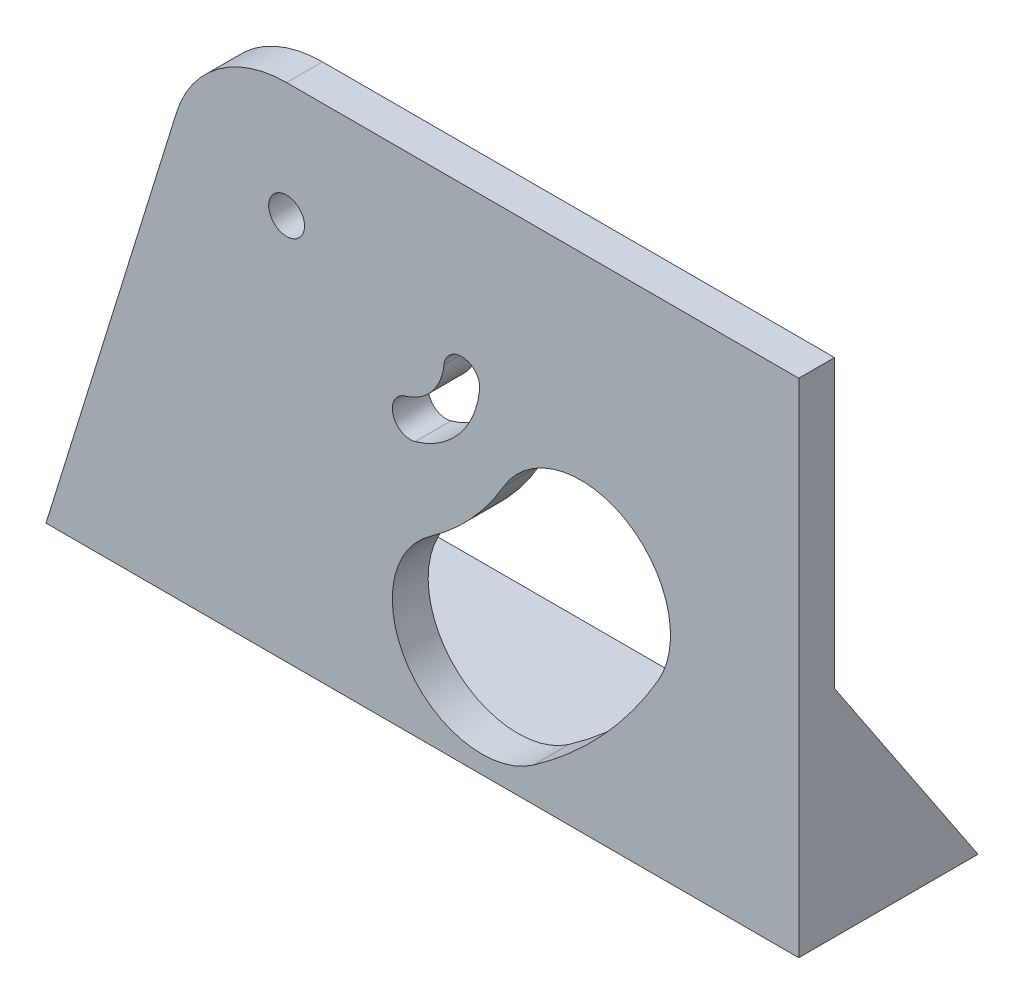
ISO-10303-21;
HEADER;
FILE_DESCRIPTION(('STEP AP214'),'2;1');
FILE_NAME('part.step','',(''),(''),'','','');
FILE_SCHEMA(('AUTOMOTIVE_DESIGN { 1 0 10303 214 1 1 1 1 }'));
ENDSEC;
DATA;
#1=APPLICATION_CONTEXT('core data for automotive mechanical design processes');
#2=APPLICATION_PROTOCOL_DEFINITION('international standard','automotive_design',2000,#1);
#3=PRODUCT_CONTEXT('',#1,'mechanical');
#4=PRODUCT('Part','Part','',(#3));
#5=PRODUCT_RELATED_PRODUCT_CATEGORY('part','',(#4));
#6=PRODUCT_DEFINITION_FORMATION('','',#4);
#7=PRODUCT_DEFINITION_CONTEXT('part definition',#1,'design');
#8=PRODUCT_DEFINITION('design','',#6,#7);
#9=PRODUCT_DEFINITION_SHAPE('','',#8);
#10=(LENGTH_UNIT() NAMED_UNIT(*) SI_UNIT(.MILLI.,.METRE.));
#11=(NAMED_UNIT(*) PLANE_ANGLE_UNIT() SI_UNIT($,.RADIAN.));
#12=(NAMED_UNIT(*) SI_UNIT($,.STERADIAN.) SOLID_ANGLE_UNIT());
#13=UNCERTAINTY_MEASURE_WITH_UNIT(LENGTH_MEASURE(1.E-05),#10,'distance_accuracy_value','');
#14=(GEOMETRIC_REPRESENTATION_CONTEXT(3) GLOBAL_UNCERTAINTY_ASSIGNED_CONTEXT((#13)) GLOBAL_UNIT_ASSIGNED_CONTEXT((#10,
#11,#12)) REPRESENTATION_CONTEXT('',''));
#15=CARTESIAN_POINT('',(0.,0.,0.));
#16=DIRECTION('',(0.,0.,1.));
#17=DIRECTION('',(1.,0.,0.));
#18=AXIS2_PLACEMENT_3D('',#15,#16,#17);
#19=CARTESIAN_POINT('',(0.,0.,0.));
#20=DIRECTION('',(0.,0.,-1.));
#21=DIRECTION('',(-1.,0.,0.));
#22=AXIS2_PLACEMENT_3D('',#19,#20,#21);
#23=PLANE('',#22);
#24=CARTESIAN_POINT('',(89.6049653149398,30.,0.));
#25=DIRECTION('',(0.,0.,1.));
#26=DIRECTION('',(1.,0.,0.));
#27=AXIS2_PLACEMENT_3D('',#24,#25,#26);
#28=CIRCLE('',#27,12.5);
#29=CARTESIAN_POINT('',(100.405906553685,23.7079678674402,0.));
#30=VERTEX_POINT('',#29);
#31=CARTESIAN_POINT('',(78.8040240761942,36.2920321325597,0.));
#32=VERTEX_POINT('',#31);
#33=EDGE_CURVE('E229',#30,#32,#28,.T.);
#34=ORIENTED_EDGE('',*,*,#33,.T.);
#35=CARTESIAN_POINT('',(48.5613886077065,53.9097221037271,0.));
#36=DIRECTION('',(0.,0.,-1.));
#37=DIRECTION('',(1.,0.,0.));
#38=AXIS2_PLACEMENT_3D('',#35,#36,#37);
#39=CIRCLE('',#38,35.);
#40=CARTESIAN_POINT('',(68.6365638799931,25.2394005536123,0.));
#41=VERTEX_POINT('',#40);
#42=EDGE_CURVE('E231',#32,#41,#39,.T.);
#43=ORIENTED_EDGE('',*,*,#42,.T.);
#44=CARTESIAN_POINT('',(75.8062693343812,15.,0.));
#45=DIRECTION('',(0.,0.,1.));
#46=DIRECTION('',(1.,0.,0.));
#47=AXIS2_PLACEMENT_3D('',#44,#45,#46);
#48=CIRCLE('',#47,12.5);
#49=CARTESIAN_POINT('',(82.9759747887693,4.76059944638758,0.));
#50=VERTEX_POINT('',#49);
#51=EDGE_CURVE('E222',#41,#50,#48,.T.);
#52=ORIENTED_EDGE('',*,*,#51,.T.);
#53=CARTESIAN_POINT('',(48.5613886077065,53.9097221037271,0.));
#54=DIRECTION('',(0.,0.,1.));
#55=DIRECTION('',(1.,0.,0.));
#56=AXIS2_PLACEMENT_3D('',#53,#54,#55);
#57=CIRCLE('',#56,60.);
#58=EDGE_CURVE('E225',#50,#30,#57,.T.);
#59=ORIENTED_EDGE('',*,*,#58,.T.);
#60=EDGE_LOOP('',(#34,#43,#52,#59));
#61=FACE_BOUND('',#60,.T.);
#62=DIRECTION('',(1.,0.,0.));
#63=VECTOR('',#62,1.);
#64=CARTESIAN_POINT('',(120.,2.,0.));
#65=LINE('',#64,#63);
#66=CARTESIAN_POINT('',(15.6201258255503,2.,0.));
#67=VERTEX_POINT('',#66);
#68=CARTESIAN_POINT('',(30.,2.,0.));
#69=VERTEX_POINT('',#68);
#70=EDGE_CURVE('E175',#67,#69,#65,.T.);
#71=ORIENTED_EDGE('',*,*,#70,.F.);
#72=DIRECTION('',(-0.296153592749172,-0.9551403297431,0.));
#73=VECTOR('',#72,1.);
#74=CARTESIAN_POINT('',(13.6843957425264,-4.24302360349572,0.));
#75=LINE('',#74,#73);
#76=CARTESIAN_POINT('',(33.1929152722023,58.6749157110409,0.));
#77=VERTEX_POINT('',#76);
#78=EDGE_CURVE('E200',#77,#67,#75,.T.);
#79=ORIENTED_EDGE('',*,*,#78,.F.);
#80=CARTESIAN_POINT('',(48.5613886077065,53.9097221037271,0.));
#81=DIRECTION('',(0.,0.,-1.));
#82=DIRECTION('',(-1.,0.,0.));
#83=AXIS2_PLACEMENT_3D('',#80,#81,#82);
#84=CIRCLE('',#83,16.0902778962729);
#85=CARTESIAN_POINT('',(48.5613886077065,70.,0.));
#86=VERTEX_POINT('',#85);
#87=EDGE_CURVE('E41',#86,#77,#84,.F.);
#88=ORIENTED_EDGE('',*,*,#87,.F.);
#89=DIRECTION('',(-1.,0.,0.));
#90=VECTOR('',#89,1.);
#91=CARTESIAN_POINT('',(0.,70.,0.));
#92=LINE('',#91,#90);
#93=CARTESIAN_POINT('',(120.,70.,0.));
#94=VERTEX_POINT('',#93);
#95=EDGE_CURVE('E11',#94,#86,#92,.T.);
#96=ORIENTED_EDGE('',*,*,#95,.F.);
#97=DIRECTION('',(0.,1.,0.));
#98=VECTOR('',#97,1.);
#99=CARTESIAN_POINT('',(120.,0.,0.));
#100=LINE('',#99,#98);
#101=CARTESIAN_POINT('',(120.,30.,0.));
#102=VERTEX_POINT('',#101);
#103=EDGE_CURVE('E247',#102,#94,#100,.T.);
#104=ORIENTED_EDGE('',*,*,#103,.F.);
#105=DIRECTION('',(1.,0.,0.));
#106=VECTOR('',#105,1.);
#107=CARTESIAN_POINT('',(120.,30.,0.));
#108=LINE('',#107,#106);
#109=CARTESIAN_POINT('',(115.,30.,0.));
#110=VERTEX_POINT('',#109);
#111=EDGE_CURVE('E319',#110,#102,#108,.T.);
#112=ORIENTED_EDGE('',*,*,#111,.F.);
#113=DIRECTION('',(0.,1.,0.));
#114=VECTOR('',#113,1.);
#115=CARTESIAN_POINT('',(115.,30.,0.));
#116=LINE('',#115,#114);
#117=CARTESIAN_POINT('',(115.,2.,0.));
#118=VERTEX_POINT('',#117);
#119=EDGE_CURVE('E316',#118,#110,#116,.T.);
#120=ORIENTED_EDGE('',*,*,#119,.F.);
#121=CARTESIAN_POINT('',(35.,2.,0.));
#122=VERTEX_POINT('',#121);
#123=EDGE_CURVE('E215',#122,#118,#65,.T.);
#124=ORIENTED_EDGE('',*,*,#123,.F.);
#125=DIRECTION('',(0.,-1.,0.));
#126=VECTOR('',#125,1.);
#127=CARTESIAN_POINT('',(35.,0.,0.));
#128=LINE('',#127,#126);
#129=CARTESIAN_POINT('',(35.,30.,0.));
#130=VERTEX_POINT('',#129);
#131=EDGE_CURVE('E307',#130,#122,#128,.T.);
#132=ORIENTED_EDGE('',*,*,#131,.F.);
#133=DIRECTION('',(1.,0.,0.));
#134=VECTOR('',#133,1.);
#135=CARTESIAN_POINT('',(35.,30.,0.));
#136=LINE('',#135,#134);
#137=CARTESIAN_POINT('',(30.,30.,0.));
#138=VERTEX_POINT('',#137);
#139=EDGE_CURVE('E310',#138,#130,#136,.T.);
#140=ORIENTED_EDGE('',*,*,#139,.F.);
#141=DIRECTION('',(0.,1.,0.));
#142=VECTOR('',#141,1.);
#143=CARTESIAN_POINT('',(30.,0.,0.));
#144=LINE('',#143,#142);
#145=EDGE_CURVE('E288',#69,#138,#144,.T.);
#146=ORIENTED_EDGE('',*,*,#145,.F.);
#147=EDGE_LOOP('',(#71,#79,#88,#96,#104,#112,#120,#124,#132,#140,#146));
#148=FACE_BOUND('',#147,.T.);
#149=CARTESIAN_POINT('',(65.8053688993652,38.,0.));
#150=DIRECTION('',(0.,0.,-1.));
#151=DIRECTION('',(-1.,0.,0.));
#152=AXIS2_PLACEMENT_3D('',#149,#150,#151);
#153=CIRCLE('',#152,2.5);
#154=CARTESIAN_POINT('',(66.4942838678402,35.5967946059042,0.));
#155=VERTEX_POINT('',#154);
#156=CARTESIAN_POINT('',(65.1164539308901,40.4032053940958,0.));
#157=VERTEX_POINT('',#156);
#158=EDGE_CURVE('E271',#155,#157,#153,.T.);
#159=ORIENTED_EDGE('',*,*,#158,.F.);
#160=CARTESIAN_POINT('',(63.0497090254651,47.6128215763831,0.));
#161=DIRECTION('',(0.,0.,-1.));
#162=DIRECTION('',(-1.,0.,0.));
#163=AXIS2_PLACEMENT_3D('',#160,#161,#162);
#164=CIRCLE('',#163,12.5);
#165=CARTESIAN_POINT('',(75.4875727436337,46.3680139092052,0.));
#166=VERTEX_POINT('',#165);
#167=EDGE_CURVE('E265',#166,#155,#164,.T.);
#168=ORIENTED_EDGE('',*,*,#167,.F.);
#169=CARTESIAN_POINT('',(73.,46.6169754426408,0.));
#170=DIRECTION('',(0.,0.,-1.));
#171=DIRECTION('',(-1.,0.,0.));
#172=AXIS2_PLACEMENT_3D('',#169,#170,#171);
#173=CIRCLE('',#172,2.5);
#174=CARTESIAN_POINT('',(70.5124272563663,46.8659369760763,0.));
#175=VERTEX_POINT('',#174);
#176=EDGE_CURVE('E267',#175,#166,#173,.T.);
#177=ORIENTED_EDGE('',*,*,#176,.F.);
#178=CARTESIAN_POINT('',(63.0497090254651,47.6128215763831,0.));
#179=DIRECTION('',(0.,0.,-1.));
#180=DIRECTION('',(-1.,0.,0.));
#181=AXIS2_PLACEMENT_3D('',#178,#179,#180);
#182=CIRCLE('',#181,7.49999999999999);
#183=EDGE_CURVE('E269',#157,#175,#182,.F.);
#184=ORIENTED_EDGE('',*,*,#183,.F.);
#185=EDGE_LOOP('',(#159,#168,#177,#184));
#186=FACE_BOUND('',#185,.T.);
#187=CARTESIAN_POINT('',(48.5613886077065,53.9097221037271,0.));
#188=DIRECTION('',(0.,0.,1.));
#189=DIRECTION('',(1.,0.,0.));
#190=AXIS2_PLACEMENT_3D('',#187,#188,#189);
#191=CIRCLE('',#190,2.5);
#192=CARTESIAN_POINT('',(51.0613886077065,53.9097221037271,0.));
#193=VERTEX_POINT('',#192);
#194=EDGE_CURVE('E237',#193,#193,#191,.T.);
#195=ORIENTED_EDGE('',*,*,#194,.T.);
#196=EDGE_LOOP('',(#195));
#197=FACE_BOUND('',#196,.T.);
#198=ADVANCED_FACE('F33',(#61,#148,#186,#197),#23,.T.);
#199=CARTESIAN_POINT('',(120.,2.,-20.));
#200=DIRECTION('',(0.,-1.,0.));
#201=DIRECTION('',(1.,0.,0.));
#202=AXIS2_PLACEMENT_3D('',#199,#200,#201);
#203=PLANE('',#202);
#204=DIRECTION('',(0.,0.,1.));
#205=VECTOR('',#204,1.);
#206=CARTESIAN_POINT('',(115.,2.,-20.));
#207=LINE('',#206,#205);
#208=CARTESIAN_POINT('',(115.,2.,-18.6666666666667));
#209=VERTEX_POINT('',#208);
#210=EDGE_CURVE('E321',#209,#118,#207,.T.);
#211=ORIENTED_EDGE('',*,*,#210,.F.);
#212=DIRECTION('',(-1.,0.,0.));
#213=VECTOR('',#212,1.);
#214=CARTESIAN_POINT('',(120.,2.,-18.6666666666667));
#215=LINE('',#214,#213);
#216=CARTESIAN_POINT('',(35.,2.,-18.6666666666667));
#217=VERTEX_POINT('',#216);
#218=EDGE_CURVE('E301',#209,#217,#215,.T.);
#219=ORIENTED_EDGE('',*,*,#218,.T.);
#220=DIRECTION('',(0.,0.,-1.));
#221=VECTOR('',#220,1.);
#222=CARTESIAN_POINT('',(35.,2.,-20.));
#223=LINE('',#222,#221);
#224=EDGE_CURVE('E313',#122,#217,#223,.T.);
#225=ORIENTED_EDGE('',*,*,#224,.F.);
#226=ORIENTED_EDGE('',*,*,#123,.T.);
#227=EDGE_LOOP('',(#211,#219,#225,#226));
#228=FACE_BOUND('',#227,.T.);
#229=ADVANCED_FACE('F345',(#228),#203,.F.);
#230=DIRECTION('',(0.,0.,1.));
#231=VECTOR('',#230,1.);
#232=CARTESIAN_POINT('',(30.,2.,-20.));
#233=LINE('',#232,#231);
#234=CARTESIAN_POINT('',(30.,2.,-18.6666666666667));
#235=VERTEX_POINT('',#234);
#236=EDGE_CURVE('E292',#235,#69,#233,.T.);
#237=ORIENTED_EDGE('',*,*,#236,.F.);
#238=DIRECTION('',(-1.,0.,0.));
#239=VECTOR('',#238,1.);
#240=CARTESIAN_POINT('',(120.,2.,-18.6666666666667));
#241=LINE('',#240,#239);
#242=CARTESIAN_POINT('',(15.6201258255503,2.,-18.6666666666667));
#243=VERTEX_POINT('',#242);
#244=EDGE_CURVE('E186',#235,#243,#241,.T.);
#245=ORIENTED_EDGE('',*,*,#244,.T.);
#246=DIRECTION('',(0.,0.,1.));
#247=VECTOR('',#246,1.);
#248=CARTESIAN_POINT('',(15.6201258255503,2.,-20.));
#249=LINE('',#248,#247);
#250=EDGE_CURVE('E184',#243,#67,#249,.T.);
#251=ORIENTED_EDGE('',*,*,#250,.T.);
#252=ORIENTED_EDGE('',*,*,#70,.T.);
#253=EDGE_LOOP('',(#237,#245,#251,#252));
#254=FACE_BOUND('',#253,.T.);
#255=ADVANCED_FACE('F291',(#254),#203,.F.);
#256=CARTESIAN_POINT('',(0.,0.,5.));
#257=DIRECTION('',(0.,1.,0.));
#258=DIRECTION('',(0.,0.,1.));
#259=AXIS2_PLACEMENT_3D('',#256,#257,#258);
#260=PLANE('',#259);
#261=DIRECTION('',(0.,0.,1.));
#262=VECTOR('',#261,1.);
#263=CARTESIAN_POINT('',(15.,0.,-20.));
#264=LINE('',#263,#262);
#265=CARTESIAN_POINT('',(15.,0.,-20.));
#266=VERTEX_POINT('',#265);
#267=CARTESIAN_POINT('',(15.,0.,5.));
#268=VERTEX_POINT('',#267);
#269=EDGE_CURVE('E181',#266,#268,#264,.T.);
#270=ORIENTED_EDGE('',*,*,#269,.F.);
#271=DIRECTION('',(-1.,0.,0.));
#272=VECTOR('',#271,1.);
#273=CARTESIAN_POINT('',(120.,0.,-20.));
#274=LINE('',#273,#272);
#275=CARTESIAN_POINT('',(120.,0.,-20.));
#276=VERTEX_POINT('',#275);
#277=EDGE_CURVE('E163',#276,#266,#274,.T.);
#278=ORIENTED_EDGE('',*,*,#277,.F.);
#279=DIRECTION('',(0.,0.,-1.));
#280=VECTOR('',#279,1.);
#281=CARTESIAN_POINT('',(120.,0.,5.));
#282=LINE('',#281,#280);
#283=CARTESIAN_POINT('',(120.,0.,5.));
#284=VERTEX_POINT('',#283);
#285=EDGE_CURVE('E262',#284,#276,#282,.T.);
#286=ORIENTED_EDGE('',*,*,#285,.F.);
#287=DIRECTION('',(1.,0.,0.));
#288=VECTOR('',#287,1.);
#289=CARTESIAN_POINT('',(0.,0.,5.));
#290=LINE('',#289,#288);
#291=EDGE_CURVE('E189',#268,#284,#290,.T.);
#292=ORIENTED_EDGE('',*,*,#291,.F.);
#293=EDGE_LOOP('',(#270,#278,#286,#292));
#294=FACE_BOUND('',#293,.T.);
#295=ADVANCED_FACE('F35',(#294),#260,.F.);
#296=CARTESIAN_POINT('',(120.,0.,5.));
#297=DIRECTION('',(-1.,0.,0.));
#298=DIRECTION('',(0.,-1.,0.));
#299=AXIS2_PLACEMENT_3D('',#296,#297,#298);
#300=PLANE('',#299);
#301=ORIENTED_EDGE('',*,*,#285,.T.);
#302=DIRECTION('',(0.,-0.832050294337844,-0.554700196225229));
#303=VECTOR('',#302,1.);
#304=CARTESIAN_POINT('',(120.,30.,0.));
#305=LINE('',#304,#303);
#306=EDGE_CURVE('E169',#102,#276,#305,.T.);
#307=ORIENTED_EDGE('',*,*,#306,.F.);
#308=ORIENTED_EDGE('',*,*,#103,.T.);
#309=DIRECTION('',(0.,0.,1.));
#310=VECTOR('',#309,1.);
#311=CARTESIAN_POINT('',(120.,70.,-20.));
#312=LINE('',#311,#310);
#313=CARTESIAN_POINT('',(120.,70.,5.));
#314=VERTEX_POINT('',#313);
#315=EDGE_CURVE('E201',#94,#314,#312,.T.);
#316=ORIENTED_EDGE('',*,*,#315,.T.);
#317=DIRECTION('',(0.,1.,0.));
#318=VECTOR('',#317,1.);
#319=CARTESIAN_POINT('',(120.,0.,5.));
#320=LINE('',#319,#318);
#321=EDGE_CURVE('E259',#284,#314,#320,.T.);
#322=ORIENTED_EDGE('',*,*,#321,.F.);
#323=EDGE_LOOP('',(#301,#307,#308,#316,#322));
#324=FACE_BOUND('',#323,.T.);
#325=ADVANCED_FACE('F334',(#324),#300,.F.);
#326=CARTESIAN_POINT('',(0.,0.,5.));
#327=DIRECTION('',(0.,0.,-1.));
#328=DIRECTION('',(-1.,0.,0.));
#329=AXIS2_PLACEMENT_3D('',#326,#327,#328);
#330=PLANE('',#329);
#331=CARTESIAN_POINT('',(63.0497090254651,47.6128215763831,5.));
#332=DIRECTION('',(0.,0.,1.));
#333=DIRECTION('',(1.,0.,0.));
#334=AXIS2_PLACEMENT_3D('',#331,#332,#333);
#335=CIRCLE('',#334,12.5);
#336=CARTESIAN_POINT('',(66.4942838678402,35.5967946059042,5.));
#337=VERTEX_POINT('',#336);
#338=CARTESIAN_POINT('',(75.4875727436337,46.3680139092052,5.));
#339=VERTEX_POINT('',#338);
#340=EDGE_CURVE('E204',#337,#339,#335,.T.);
#341=ORIENTED_EDGE('',*,*,#340,.F.);
#342=CARTESIAN_POINT('',(65.8053688993652,38.,5.));
#343=DIRECTION('',(0.,0.,1.));
#344=DIRECTION('',(1.,0.,0.));
#345=AXIS2_PLACEMENT_3D('',#342,#343,#344);
#346=CIRCLE('',#345,2.5);
#347=CARTESIAN_POINT('',(65.1164539308901,40.4032053940958,5.));
#348=VERTEX_POINT('',#347);
#349=EDGE_CURVE('E48',#348,#337,#346,.T.);
#350=ORIENTED_EDGE('',*,*,#349,.F.);
#351=CARTESIAN_POINT('',(63.0497090254651,47.6128215763831,5.));
#352=DIRECTION('',(0.,0.,-1.));
#353=DIRECTION('',(1.,0.,0.));
#354=AXIS2_PLACEMENT_3D('',#351,#352,#353);
#355=CIRCLE('',#354,7.49999999999999);
#356=CARTESIAN_POINT('',(70.5124272563663,46.8659369760763,5.));
#357=VERTEX_POINT('',#356);
#358=EDGE_CURVE('E209',#357,#348,#355,.T.);
#359=ORIENTED_EDGE('',*,*,#358,.F.);
#360=CARTESIAN_POINT('',(73.,46.6169754426408,5.));
#361=DIRECTION('',(0.,0.,1.));
#362=DIRECTION('',(1.,0.,0.));
#363=AXIS2_PLACEMENT_3D('',#360,#361,#362);
#364=CIRCLE('',#363,2.5);
#365=EDGE_CURVE('E206',#339,#357,#364,.T.);
#366=ORIENTED_EDGE('',*,*,#365,.F.);
#367=EDGE_LOOP('',(#341,#350,#359,#366));
#368=FACE_BOUND('',#367,.T.);
#369=CARTESIAN_POINT('',(48.5613886077065,53.9097221037271,5.));
#370=DIRECTION('',(0.,0.,1.));
#371=DIRECTION('',(1.,0.,0.));
#372=AXIS2_PLACEMENT_3D('',#369,#370,#371);
#373=CIRCLE('',#372,60.);
#374=CARTESIAN_POINT('',(82.9759747887693,4.76059944638758,5.));
#375=VERTEX_POINT('',#374);
#376=CARTESIAN_POINT('',(100.405906553685,23.7079678674402,5.));
#377=VERTEX_POINT('',#376);
#378=EDGE_CURVE('E236',#375,#377,#373,.T.);
#379=ORIENTED_EDGE('',*,*,#378,.F.);
#380=CARTESIAN_POINT('',(75.8062693343812,15.,5.));
#381=DIRECTION('',(0.,0.,1.));
#382=DIRECTION('',(1.,0.,0.));
#383=AXIS2_PLACEMENT_3D('',#380,#381,#382);
#384=CIRCLE('',#383,12.5);
#385=CARTESIAN_POINT('',(68.6365638799931,25.2394005536123,5.));
#386=VERTEX_POINT('',#385);
#387=EDGE_CURVE('E234',#386,#375,#384,.T.);
#388=ORIENTED_EDGE('',*,*,#387,.F.);
#389=CARTESIAN_POINT('',(48.5613886077065,53.9097221037271,5.));
#390=DIRECTION('',(0.,0.,-1.));
#391=DIRECTION('',(1.,0.,0.));
#392=AXIS2_PLACEMENT_3D('',#389,#390,#391);
#393=CIRCLE('',#392,35.);
#394=CARTESIAN_POINT('',(78.8040240761942,36.2920321325597,5.));
#395=VERTEX_POINT('',#394);
#396=EDGE_CURVE('E226',#395,#386,#393,.T.);
#397=ORIENTED_EDGE('',*,*,#396,.F.);
#398=CARTESIAN_POINT('',(89.6049653149398,30.,5.));
#399=DIRECTION('',(0.,0.,1.));
#400=DIRECTION('',(1.,0.,0.));
#401=AXIS2_PLACEMENT_3D('',#398,#399,#400);
#402=CIRCLE('',#401,12.5);
#403=EDGE_CURVE('E240',#377,#395,#402,.T.);
#404=ORIENTED_EDGE('',*,*,#403,.F.);
#405=EDGE_LOOP('',(#379,#388,#397,#404));
#406=FACE_BOUND('',#405,.T.);
#407=CARTESIAN_POINT('',(48.5613886077065,53.9097221037271,5.));
#408=DIRECTION('',(0.,0.,1.));
#409=DIRECTION('',(1.,0.,0.));
#410=AXIS2_PLACEMENT_3D('',#407,#408,#409);
#411=CIRCLE('',#410,2.5);
#412=CARTESIAN_POINT('',(51.0613886077065,53.9097221037271,5.));
#413=VERTEX_POINT('',#412);
#414=EDGE_CURVE('E174',#413,#413,#411,.T.);
#415=ORIENTED_EDGE('',*,*,#414,.F.);
#416=EDGE_LOOP('',(#415));
#417=FACE_BOUND('',#416,.T.);
#418=ORIENTED_EDGE('',*,*,#321,.T.);
#419=DIRECTION('',(1.,0.,0.));
#420=VECTOR('',#419,1.);
#421=CARTESIAN_POINT('',(120.,70.,5.));
#422=LINE('',#421,#420);
#423=CARTESIAN_POINT('',(48.5613886077065,70.,5.));
#424=VERTEX_POINT('',#423);
#425=EDGE_CURVE('E191',#424,#314,#422,.T.);
#426=ORIENTED_EDGE('',*,*,#425,.F.);
#427=CARTESIAN_POINT('',(48.5613886077065,53.9097221037271,5.));
#428=DIRECTION('',(0.,0.,-1.));
#429=DIRECTION('',(1.,0.,0.));
#430=AXIS2_PLACEMENT_3D('',#427,#428,#429);
#431=CIRCLE('',#430,16.0902778962729);
#432=CARTESIAN_POINT('',(33.1929152722023,58.6749157110409,5.));
#433=VERTEX_POINT('',#432);
#434=EDGE_CURVE('E195',#433,#424,#431,.T.);
#435=ORIENTED_EDGE('',*,*,#434,.F.);
#436=DIRECTION('',(0.296153592749172,0.9551403297431,0.));
#437=VECTOR('',#436,1.);
#438=CARTESIAN_POINT('',(33.1929152722023,58.6749157110409,5.));
#439=LINE('',#438,#437);
#440=EDGE_CURVE('E281',#268,#433,#439,.T.);
#441=ORIENTED_EDGE('',*,*,#440,.F.);
#442=ORIENTED_EDGE('',*,*,#291,.T.);
#443=EDGE_LOOP('',(#418,#426,#435,#441,#442));
#444=FACE_BOUND('',#443,.T.);
#445=ADVANCED_FACE('F331',(#368,#406,#417,#444),#330,.F.);
#446=CARTESIAN_POINT('',(48.5613886077065,53.9097221037271,0.));
#447=DIRECTION('',(0.,0.,1.));
#448=DIRECTION('',(1.,0.,0.));
#449=AXIS2_PLACEMENT_3D('',#446,#447,#448);
#450=CYLINDRICAL_SURFACE('',#449,2.5);
#451=ORIENTED_EDGE('',*,*,#194,.F.);
#452=EDGE_LOOP('',(#451));
#453=FACE_BOUND('',#452,.T.);
#454=ORIENTED_EDGE('',*,*,#414,.T.);
#455=EDGE_LOOP('',(#454));
#456=FACE_BOUND('',#455,.T.);
#457=ADVANCED_FACE('F373',(#453,#456),#450,.F.);
#458=CARTESIAN_POINT('',(75.8062693343812,15.,0.));
#459=DIRECTION('',(0.,0.,1.));
#460=DIRECTION('',(1.,0.,0.));
#461=AXIS2_PLACEMENT_3D('',#458,#459,#460);
#462=CYLINDRICAL_SURFACE('',#461,12.5);
#463=ORIENTED_EDGE('',*,*,#387,.T.);
#464=DIRECTION('',(0.,0.,1.));
#465=VECTOR('',#464,1.);
#466=CARTESIAN_POINT('',(82.9759747887693,4.76059944638758,0.));
#467=LINE('',#466,#465);
#468=EDGE_CURVE('E233',#50,#375,#467,.T.);
#469=ORIENTED_EDGE('',*,*,#468,.F.);
#470=ORIENTED_EDGE('',*,*,#51,.F.);
#471=DIRECTION('',(0.,0.,1.));
#472=VECTOR('',#471,1.);
#473=CARTESIAN_POINT('',(68.6365638799931,25.2394005536123,0.));
#474=LINE('',#473,#472);
#475=EDGE_CURVE('E245',#41,#386,#474,.T.);
#476=ORIENTED_EDGE('',*,*,#475,.T.);
#477=EDGE_LOOP('',(#463,#469,#470,#476));
#478=FACE_BOUND('',#477,.T.);
#479=ADVANCED_FACE('F388',(#478),#462,.F.);
#480=CARTESIAN_POINT('',(48.5613886077065,53.9097221037271,0.));
#481=DIRECTION('',(0.,0.,1.));
#482=DIRECTION('',(1.,0.,0.));
#483=AXIS2_PLACEMENT_3D('',#480,#481,#482);
#484=CYLINDRICAL_SURFACE('',#483,35.);
#485=ORIENTED_EDGE('',*,*,#396,.T.);
#486=ORIENTED_EDGE('',*,*,#475,.F.);
#487=ORIENTED_EDGE('',*,*,#42,.F.);
#488=DIRECTION('',(0.,0.,1.));
#489=VECTOR('',#488,1.);
#490=CARTESIAN_POINT('',(78.8040240761942,36.2920321325597,0.));
#491=LINE('',#490,#489);
#492=EDGE_CURVE('E248',#32,#395,#491,.T.);
#493=ORIENTED_EDGE('',*,*,#492,.T.);
#494=EDGE_LOOP('',(#485,#486,#487,#493));
#495=FACE_BOUND('',#494,.T.);
#496=ADVANCED_FACE('F384',(#495),#484,.T.);
#497=CARTESIAN_POINT('',(89.6049653149398,30.,0.));
#498=DIRECTION('',(0.,0.,1.));
#499=DIRECTION('',(1.,0.,0.));
#500=AXIS2_PLACEMENT_3D('',#497,#498,#499);
#501=CYLINDRICAL_SURFACE('',#500,12.5);
#502=ORIENTED_EDGE('',*,*,#403,.T.);
#503=ORIENTED_EDGE('',*,*,#492,.F.);
#504=ORIENTED_EDGE('',*,*,#33,.F.);
#505=DIRECTION('',(0.,0.,1.));
#506=VECTOR('',#505,1.);
#507=CARTESIAN_POINT('',(100.405906553685,23.7079678674402,0.));
#508=LINE('',#507,#506);
#509=EDGE_CURVE('E250',#30,#377,#508,.T.);
#510=ORIENTED_EDGE('',*,*,#509,.T.);
#511=EDGE_LOOP('',(#502,#503,#504,#510));
#512=FACE_BOUND('',#511,.T.);
#513=ADVANCED_FACE('F387',(#512),#501,.F.);
#514=CARTESIAN_POINT('',(48.5613886077065,53.9097221037271,0.));
#515=DIRECTION('',(0.,0.,1.));
#516=DIRECTION('',(1.,0.,0.));
#517=AXIS2_PLACEMENT_3D('',#514,#515,#516);
#518=CYLINDRICAL_SURFACE('',#517,60.);
#519=ORIENTED_EDGE('',*,*,#378,.T.);
#520=ORIENTED_EDGE('',*,*,#509,.F.);
#521=ORIENTED_EDGE('',*,*,#58,.F.);
#522=ORIENTED_EDGE('',*,*,#468,.T.);
#523=EDGE_LOOP('',(#519,#520,#521,#522));
#524=FACE_BOUND('',#523,.T.);
#525=ADVANCED_FACE('F392',(#524),#518,.F.);
#526=CARTESIAN_POINT('',(65.8053688993652,38.,-20.));
#527=DIRECTION('',(0.,0.,1.));
#528=DIRECTION('',(1.,0.,0.));
#529=AXIS2_PLACEMENT_3D('',#526,#527,#528);
#530=CYLINDRICAL_SURFACE('',#529,2.5);
#531=ORIENTED_EDGE('',*,*,#158,.T.);
#532=DIRECTION('',(0.,0.,1.));
#533=VECTOR('',#532,1.);
#534=CARTESIAN_POINT('',(65.1164539308901,40.4032053940958,-20.));
#535=LINE('',#534,#533);
#536=EDGE_CURVE('E213',#157,#348,#535,.T.);
#537=ORIENTED_EDGE('',*,*,#536,.T.);
#538=ORIENTED_EDGE('',*,*,#349,.T.);
#539=DIRECTION('',(0.,0.,1.));
#540=VECTOR('',#539,1.);
#541=CARTESIAN_POINT('',(66.4942838678402,35.5967946059042,-20.));
#542=LINE('',#541,#540);
#543=EDGE_CURVE('E212',#155,#337,#542,.T.);
#544=ORIENTED_EDGE('',*,*,#543,.F.);
#545=EDGE_LOOP('',(#531,#537,#538,#544));
#546=FACE_BOUND('',#545,.T.);
#547=ADVANCED_FACE('F382',(#546),#530,.F.);
#548=CARTESIAN_POINT('',(63.0497090254651,47.6128215763831,-20.));
#549=DIRECTION('',(0.,0.,1.));
#550=DIRECTION('',(1.,0.,0.));
#551=AXIS2_PLACEMENT_3D('',#548,#549,#550);
#552=CYLINDRICAL_SURFACE('',#551,7.49999999999999);
#553=ORIENTED_EDGE('',*,*,#183,.T.);
#554=DIRECTION('',(0.,0.,1.));
#555=VECTOR('',#554,1.);
#556=CARTESIAN_POINT('',(70.5124272563663,46.8659369760763,-20.));
#557=LINE('',#556,#555);
#558=EDGE_CURVE('E216',#175,#357,#557,.T.);
#559=ORIENTED_EDGE('',*,*,#558,.T.);
#560=ORIENTED_EDGE('',*,*,#358,.T.);
#561=ORIENTED_EDGE('',*,*,#536,.F.);
#562=EDGE_LOOP('',(#553,#559,#560,#561));
#563=FACE_BOUND('',#562,.T.);
#564=ADVANCED_FACE('F433',(#563),#552,.T.);
#565=CARTESIAN_POINT('',(73.,46.6169754426408,-20.));
#566=DIRECTION('',(0.,0.,1.));
#567=DIRECTION('',(1.,0.,0.));
#568=AXIS2_PLACEMENT_3D('',#565,#566,#567);
#569=CYLINDRICAL_SURFACE('',#568,2.5);
#570=ORIENTED_EDGE('',*,*,#176,.T.);
#571=DIRECTION('',(0.,0.,1.));
#572=VECTOR('',#571,1.);
#573=CARTESIAN_POINT('',(75.4875727436337,46.3680139092052,-20.));
#574=LINE('',#573,#572);
#575=EDGE_CURVE('E56',#166,#339,#574,.T.);
#576=ORIENTED_EDGE('',*,*,#575,.T.);
#577=ORIENTED_EDGE('',*,*,#365,.T.);
#578=ORIENTED_EDGE('',*,*,#558,.F.);
#579=EDGE_LOOP('',(#570,#576,#577,#578));
#580=FACE_BOUND('',#579,.T.);
#581=ADVANCED_FACE('F439',(#580),#569,.F.);
#582=CARTESIAN_POINT('',(63.0497090254651,47.6128215763831,-20.));
#583=DIRECTION('',(0.,0.,1.));
#584=DIRECTION('',(1.,0.,0.));
#585=AXIS2_PLACEMENT_3D('',#582,#583,#584);
#586=CYLINDRICAL_SURFACE('',#585,12.5);
#587=ORIENTED_EDGE('',*,*,#167,.T.);
#588=ORIENTED_EDGE('',*,*,#543,.T.);
#589=ORIENTED_EDGE('',*,*,#340,.T.);
#590=ORIENTED_EDGE('',*,*,#575,.F.);
#591=EDGE_LOOP('',(#587,#588,#589,#590));
#592=FACE_BOUND('',#591,.T.);
#593=ADVANCED_FACE('F447',(#592),#586,.F.);
#594=CARTESIAN_POINT('',(120.,70.,-20.));
#595=DIRECTION('',(0.,-1.,0.));
#596=DIRECTION('',(1.,0.,0.));
#597=AXIS2_PLACEMENT_3D('',#594,#595,#596);
#598=PLANE('',#597);
#599=ORIENTED_EDGE('',*,*,#95,.T.);
#600=DIRECTION('',(0.,0.,1.));
#601=VECTOR('',#600,1.);
#602=CARTESIAN_POINT('',(48.5613886077065,70.,-20.));
#603=LINE('',#602,#601);
#604=EDGE_CURVE('E193',#86,#424,#603,.T.);
#605=ORIENTED_EDGE('',*,*,#604,.T.);
#606=ORIENTED_EDGE('',*,*,#425,.T.);
#607=ORIENTED_EDGE('',*,*,#315,.F.);
#608=EDGE_LOOP('',(#599,#605,#606,#607));
#609=FACE_BOUND('',#608,.T.);
#610=ADVANCED_FACE('F327',(#609),#598,.F.);
#611=CARTESIAN_POINT('',(48.5613886077065,53.9097221037271,-20.));
#612=DIRECTION('',(0.,0.,1.));
#613=DIRECTION('',(1.,0.,0.));
#614=AXIS2_PLACEMENT_3D('',#611,#612,#613);
#615=CYLINDRICAL_SURFACE('',#614,16.0902778962729);
#616=ORIENTED_EDGE('',*,*,#87,.T.);
#617=DIRECTION('',(0.,0.,1.));
#618=VECTOR('',#617,1.);
#619=CARTESIAN_POINT('',(33.1929152722023,58.6749157110409,-20.));
#620=LINE('',#619,#618);
#621=EDGE_CURVE('E190',#77,#433,#620,.T.);
#622=ORIENTED_EDGE('',*,*,#621,.T.);
#623=ORIENTED_EDGE('',*,*,#434,.T.);
#624=ORIENTED_EDGE('',*,*,#604,.F.);
#625=EDGE_LOOP('',(#616,#622,#623,#624));
#626=FACE_BOUND('',#625,.T.);
#627=ADVANCED_FACE('F276',(#626),#615,.T.);
#628=CARTESIAN_POINT('',(33.1929152722023,58.6749157110409,-20.));
#629=DIRECTION('',(0.9551403297431,-0.296153592749172,0.));
#630=DIRECTION('',(0.296153592749172,0.9551403297431,0.));
#631=AXIS2_PLACEMENT_3D('',#628,#629,#630);
#632=PLANE('',#631);
#633=ORIENTED_EDGE('',*,*,#250,.F.);
#634=DIRECTION('',(-0.24980849785958,-0.805670357746806,-0.537113571831204));
#635=VECTOR('',#634,1.);
#636=CARTESIAN_POINT('',(27.9444231517078,41.7477312454146,7.83182083027642));
#637=LINE('',#636,#635);
#638=EDGE_CURVE('E166',#243,#266,#637,.T.);
#639=ORIENTED_EDGE('',*,*,#638,.T.);
#640=ORIENTED_EDGE('',*,*,#269,.T.);
#641=ORIENTED_EDGE('',*,*,#440,.T.);
#642=ORIENTED_EDGE('',*,*,#621,.F.);
#643=ORIENTED_EDGE('',*,*,#78,.T.);
#644=EDGE_LOOP('',(#633,#639,#640,#641,#642,#643));
#645=FACE_BOUND('',#644,.T.);
#646=ADVANCED_FACE('F179',(#645),#632,.F.);
#647=CARTESIAN_POINT('',(115.,30.,-20.));
#648=DIRECTION('',(1.,0.,0.));
#649=DIRECTION('',(0.,0.,-1.));
#650=AXIS2_PLACEMENT_3D('',#647,#648,#649);
#651=PLANE('',#650);
#652=ORIENTED_EDGE('',*,*,#119,.T.);
#653=DIRECTION('',(0.,-0.832050294337844,-0.554700196225229));
#654=VECTOR('',#653,1.);
#655=CARTESIAN_POINT('',(115.,20.7692307692308,-6.15384615384616));
#656=LINE('',#655,#654);
#657=EDGE_CURVE('E304',#110,#209,#656,.T.);
#658=ORIENTED_EDGE('',*,*,#657,.T.);
#659=ORIENTED_EDGE('',*,*,#210,.T.);
#660=EDGE_LOOP('',(#652,#658,#659));
#661=FACE_BOUND('',#660,.T.);
#662=ADVANCED_FACE('F341',(#661),#651,.F.);
#663=CARTESIAN_POINT('',(35.,0.,-20.));
#664=DIRECTION('',(-1.,0.,0.));
#665=DIRECTION('',(0.,0.,1.));
#666=AXIS2_PLACEMENT_3D('',#663,#664,#665);
#667=PLANE('',#666);
#668=ORIENTED_EDGE('',*,*,#224,.T.);
#669=DIRECTION('',(0.,0.832050294337844,0.554700196225229));
#670=VECTOR('',#669,1.);
#671=CARTESIAN_POINT('',(35.,0.,-20.));
#672=LINE('',#671,#670);
#673=EDGE_CURVE('E185',#217,#130,#672,.T.);
#674=ORIENTED_EDGE('',*,*,#673,.T.);
#675=ORIENTED_EDGE('',*,*,#131,.T.);
#676=EDGE_LOOP('',(#668,#674,#675));
#677=FACE_BOUND('',#676,.T.);
#678=ADVANCED_FACE('F348',(#677),#667,.F.);
#679=CARTESIAN_POINT('',(30.,0.,-20.));
#680=DIRECTION('',(1.,0.,0.));
#681=DIRECTION('',(0.,0.,-1.));
#682=AXIS2_PLACEMENT_3D('',#679,#680,#681);
#683=PLANE('',#682);
#684=ORIENTED_EDGE('',*,*,#145,.T.);
#685=DIRECTION('',(0.,-0.832050294337844,-0.554700196225229));
#686=VECTOR('',#685,1.);
#687=CARTESIAN_POINT('',(30.,0.,-20.));
#688=LINE('',#687,#686);
#689=EDGE_CURVE('E294',#138,#235,#688,.T.);
#690=ORIENTED_EDGE('',*,*,#689,.T.);
#691=ORIENTED_EDGE('',*,*,#236,.T.);
#692=EDGE_LOOP('',(#684,#690,#691));
#693=FACE_BOUND('',#692,.T.);
#694=ADVANCED_FACE('F350',(#693),#683,.F.);
#695=CARTESIAN_POINT('',(15.,30.,0.));
#696=DIRECTION('',(0.,-0.554700196225229,0.832050294337844));
#697=DIRECTION('',(0.,-0.832050294337844,-0.554700196225229));
#698=AXIS2_PLACEMENT_3D('',#695,#696,#697);
#699=PLANE('',#698);
#700=ORIENTED_EDGE('',*,*,#111,.T.);
#701=ORIENTED_EDGE('',*,*,#306,.T.);
#702=ORIENTED_EDGE('',*,*,#277,.T.);
#703=ORIENTED_EDGE('',*,*,#638,.F.);
#704=ORIENTED_EDGE('',*,*,#244,.F.);
#705=ORIENTED_EDGE('',*,*,#689,.F.);
#706=ORIENTED_EDGE('',*,*,#139,.T.);
#707=ORIENTED_EDGE('',*,*,#673,.F.);
#708=ORIENTED_EDGE('',*,*,#218,.F.);
#709=ORIENTED_EDGE('',*,*,#657,.F.);
#710=EDGE_LOOP('',(#700,#701,#702,#703,#704,#705,#706,#707,#708,#709));
#711=FACE_BOUND('',#710,.T.);
#712=ADVANCED_FACE('F165',(#711),#699,.F.);
#713=CLOSED_SHELL('',(#198,#229,#255,#295,#325,#445,#457,#479,#496,#513,#525,#547,#564,#581,
#593,#610,#627,#646,#662,#678,#694,#712));
#714=MANIFOLD_SOLID_BREP('B2',#713);
#715=ADVANCED_BREP_SHAPE_REPRESENTATION('',(#18,#714),#14);
#716=SHAPE_DEFINITION_REPRESENTATION(#9,#715);
ENDSEC;
END-ISO-10303-21;
